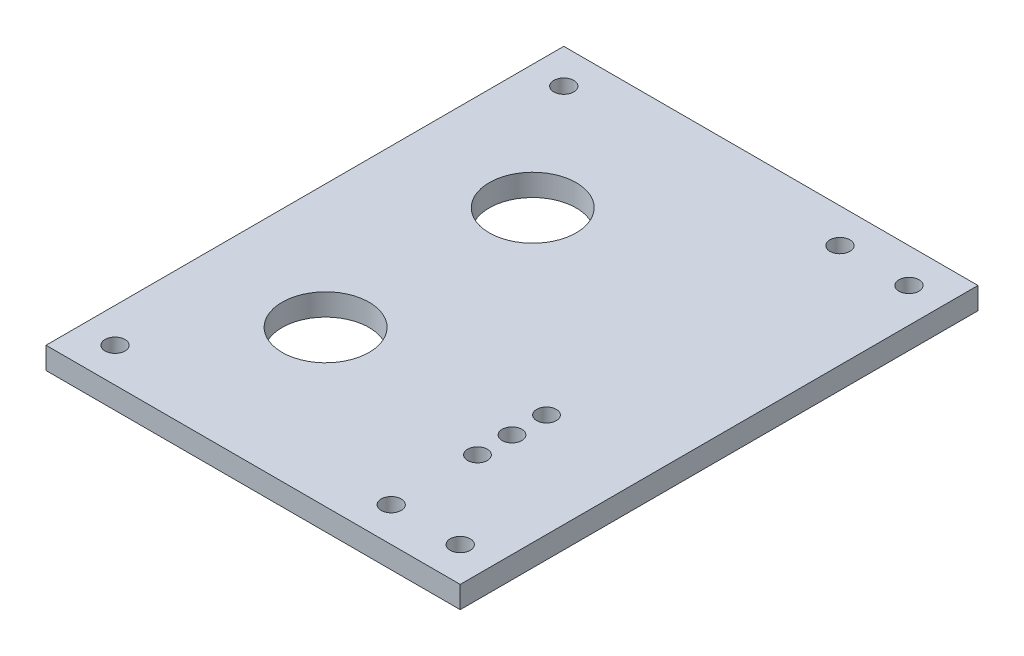
ISO-10303-21;
HEADER;
FILE_DESCRIPTION(('STEP AP214'),'2;1');
FILE_NAME('part.step','',(''),(''),'','','');
FILE_SCHEMA(('AUTOMOTIVE_DESIGN { 1 0 10303 214 1 1 1 1 }'));
ENDSEC;
DATA;
#1=APPLICATION_CONTEXT('core data for automotive mechanical design processes');
#2=APPLICATION_PROTOCOL_DEFINITION('international standard','automotive_design',2000,#1);
#3=PRODUCT_CONTEXT('',#1,'mechanical');
#4=PRODUCT('Part','Part','',(#3));
#5=PRODUCT_RELATED_PRODUCT_CATEGORY('part','',(#4));
#6=PRODUCT_DEFINITION_FORMATION('','',#4);
#7=PRODUCT_DEFINITION_CONTEXT('part definition',#1,'design');
#8=PRODUCT_DEFINITION('design','',#6,#7);
#9=PRODUCT_DEFINITION_SHAPE('','',#8);
#10=(LENGTH_UNIT() NAMED_UNIT(*) SI_UNIT(.MILLI.,.METRE.));
#11=(NAMED_UNIT(*) PLANE_ANGLE_UNIT() SI_UNIT($,.RADIAN.));
#12=(NAMED_UNIT(*) SI_UNIT($,.STERADIAN.) SOLID_ANGLE_UNIT());
#13=UNCERTAINTY_MEASURE_WITH_UNIT(LENGTH_MEASURE(1.E-05),#10,'distance_accuracy_value','');
#14=(GEOMETRIC_REPRESENTATION_CONTEXT(3) GLOBAL_UNCERTAINTY_ASSIGNED_CONTEXT((#13)) GLOBAL_UNIT_ASSIGNED_CONTEXT((#10,
#11,#12)) REPRESENTATION_CONTEXT('',''));
#15=CARTESIAN_POINT('',(0.,0.,0.));
#16=DIRECTION('',(0.,0.,1.));
#17=DIRECTION('',(1.,0.,0.));
#18=AXIS2_PLACEMENT_3D('',#15,#16,#17);
#19=CARTESIAN_POINT('',(30.,3.175,37.5));
#20=DIRECTION('',(-1.,0.,0.));
#21=DIRECTION('',(0.,0.,1.));
#22=AXIS2_PLACEMENT_3D('',#19,#20,#21);
#23=PLANE('',#22);
#24=DIRECTION('',(0.,0.,-1.));
#25=VECTOR('',#24,1.);
#26=CARTESIAN_POINT('',(30.,0.,37.5));
#27=LINE('',#26,#25);
#28=CARTESIAN_POINT('',(30.,0.,37.5));
#29=VERTEX_POINT('',#28);
#30=CARTESIAN_POINT('',(30.,0.,-37.5));
#31=VERTEX_POINT('',#30);
#32=EDGE_CURVE('E93',#29,#31,#27,.T.);
#33=ORIENTED_EDGE('',*,*,#32,.T.);
#34=DIRECTION('',(0.,-1.,0.));
#35=VECTOR('',#34,1.);
#36=CARTESIAN_POINT('',(30.,3.175,-37.5));
#37=LINE('',#36,#35);
#38=CARTESIAN_POINT('',(30.,3.175,-37.5));
#39=VERTEX_POINT('',#38);
#40=EDGE_CURVE('E11',#39,#31,#37,.T.);
#41=ORIENTED_EDGE('',*,*,#40,.F.);
#42=DIRECTION('',(0.,0.,-1.));
#43=VECTOR('',#42,1.);
#44=CARTESIAN_POINT('',(30.,3.175,37.5));
#45=LINE('',#44,#43);
#46=CARTESIAN_POINT('',(30.,3.175,37.5));
#47=VERTEX_POINT('',#46);
#48=EDGE_CURVE('E81',#47,#39,#45,.T.);
#49=ORIENTED_EDGE('',*,*,#48,.F.);
#50=DIRECTION('',(0.,-1.,0.));
#51=VECTOR('',#50,1.);
#52=CARTESIAN_POINT('',(30.,3.175,37.5));
#53=LINE('',#52,#51);
#54=EDGE_CURVE('E89',#47,#29,#53,.T.);
#55=ORIENTED_EDGE('',*,*,#54,.T.);
#56=EDGE_LOOP('',(#33,#41,#49,#55));
#57=FACE_BOUND('',#56,.T.);
#58=ADVANCED_FACE('F30',(#57),#23,.F.);
#59=CARTESIAN_POINT('',(-30.,3.175,-37.5));
#60=DIRECTION('',(0.,0.,1.));
#61=DIRECTION('',(1.,0.,0.));
#62=AXIS2_PLACEMENT_3D('',#59,#60,#61);
#63=PLANE('',#62);
#64=DIRECTION('',(-1.,0.,0.));
#65=VECTOR('',#64,1.);
#66=CARTESIAN_POINT('',(-30.,0.,-37.5));
#67=LINE('',#66,#65);
#68=CARTESIAN_POINT('',(-30.,0.,-37.5));
#69=VERTEX_POINT('',#68);
#70=EDGE_CURVE('E85',#31,#69,#67,.T.);
#71=ORIENTED_EDGE('',*,*,#70,.T.);
#72=DIRECTION('',(0.,-1.,0.));
#73=VECTOR('',#72,1.);
#74=CARTESIAN_POINT('',(-30.,3.175,-37.5));
#75=LINE('',#74,#73);
#76=CARTESIAN_POINT('',(-30.,3.175,-37.5));
#77=VERTEX_POINT('',#76);
#78=EDGE_CURVE('E38',#77,#69,#75,.T.);
#79=ORIENTED_EDGE('',*,*,#78,.F.);
#80=DIRECTION('',(-1.,0.,0.));
#81=VECTOR('',#80,1.);
#82=CARTESIAN_POINT('',(-30.,3.175,-37.5));
#83=LINE('',#82,#81);
#84=EDGE_CURVE('E76',#39,#77,#83,.T.);
#85=ORIENTED_EDGE('',*,*,#84,.F.);
#86=ORIENTED_EDGE('',*,*,#40,.T.);
#87=EDGE_LOOP('',(#71,#79,#85,#86));
#88=FACE_BOUND('',#87,.T.);
#89=ADVANCED_FACE('F84',(#88),#63,.F.);
#90=CARTESIAN_POINT('',(-30.,3.175,37.5));
#91=DIRECTION('',(1.,0.,0.));
#92=DIRECTION('',(0.,0.,-1.));
#93=AXIS2_PLACEMENT_3D('',#90,#91,#92);
#94=PLANE('',#93);
#95=DIRECTION('',(0.,0.,1.));
#96=VECTOR('',#95,1.);
#97=CARTESIAN_POINT('',(-30.,0.,37.5));
#98=LINE('',#97,#96);
#99=CARTESIAN_POINT('',(-30.,0.,37.5));
#100=VERTEX_POINT('',#99);
#101=EDGE_CURVE('E63',#69,#100,#98,.T.);
#102=ORIENTED_EDGE('',*,*,#101,.T.);
#103=DIRECTION('',(0.,-1.,0.));
#104=VECTOR('',#103,1.);
#105=CARTESIAN_POINT('',(-30.,3.175,37.5));
#106=LINE('',#105,#104);
#107=CARTESIAN_POINT('',(-30.,3.175,37.5));
#108=VERTEX_POINT('',#107);
#109=EDGE_CURVE('E86',#108,#100,#106,.T.);
#110=ORIENTED_EDGE('',*,*,#109,.F.);
#111=DIRECTION('',(0.,0.,1.));
#112=VECTOR('',#111,1.);
#113=CARTESIAN_POINT('',(-30.,3.175,37.5));
#114=LINE('',#113,#112);
#115=EDGE_CURVE('E79',#77,#108,#114,.T.);
#116=ORIENTED_EDGE('',*,*,#115,.F.);
#117=ORIENTED_EDGE('',*,*,#78,.T.);
#118=EDGE_LOOP('',(#102,#110,#116,#117));
#119=FACE_BOUND('',#118,.T.);
#120=ADVANCED_FACE('F87',(#119),#94,.F.);
#121=CARTESIAN_POINT('',(-30.,3.175,37.5));
#122=DIRECTION('',(0.,0.,-1.));
#123=DIRECTION('',(-1.,0.,0.));
#124=AXIS2_PLACEMENT_3D('',#121,#122,#123);
#125=PLANE('',#124);
#126=DIRECTION('',(1.,0.,0.));
#127=VECTOR('',#126,1.);
#128=CARTESIAN_POINT('',(-30.,0.,37.5));
#129=LINE('',#128,#127);
#130=EDGE_CURVE('E69',#100,#29,#129,.T.);
#131=ORIENTED_EDGE('',*,*,#130,.T.);
#132=ORIENTED_EDGE('',*,*,#54,.F.);
#133=DIRECTION('',(1.,0.,0.));
#134=VECTOR('',#133,1.);
#135=CARTESIAN_POINT('',(-30.,3.175,37.5));
#136=LINE('',#135,#134);
#137=EDGE_CURVE('E46',#108,#47,#136,.T.);
#138=ORIENTED_EDGE('',*,*,#137,.F.);
#139=ORIENTED_EDGE('',*,*,#109,.T.);
#140=EDGE_LOOP('',(#131,#132,#138,#139));
#141=FACE_BOUND('',#140,.T.);
#142=ADVANCED_FACE('F101',(#141),#125,.F.);
#143=CARTESIAN_POINT('',(30.,3.175,-37.5));
#144=DIRECTION('',(0.,-1.,0.));
#145=DIRECTION('',(0.,0.,-1.));
#146=AXIS2_PLACEMENT_3D('',#143,#144,#145);
#147=PLANE('',#146);
#148=CARTESIAN_POINT('',(15.,3.175,10.));
#149=DIRECTION('',(0.,1.,0.));
#150=DIRECTION('',(0.,0.,1.));
#151=AXIS2_PLACEMENT_3D('',#148,#149,#150);
#152=CIRCLE('',#151,1.425);
#153=CARTESIAN_POINT('',(15.,3.175,11.425));
#154=VERTEX_POINT('',#153);
#155=EDGE_CURVE('E167',#154,#154,#152,.T.);
#156=ORIENTED_EDGE('',*,*,#155,.F.);
#157=EDGE_LOOP('',(#156));
#158=FACE_BOUND('',#157,.T.);
#159=CARTESIAN_POINT('',(15.,3.175,15.));
#160=DIRECTION('',(0.,1.,0.));
#161=DIRECTION('',(0.,0.,1.));
#162=AXIS2_PLACEMENT_3D('',#159,#160,#161);
#163=CIRCLE('',#162,1.425);
#164=CARTESIAN_POINT('',(15.,3.175,16.425));
#165=VERTEX_POINT('',#164);
#166=EDGE_CURVE('E161',#165,#165,#163,.T.);
#167=ORIENTED_EDGE('',*,*,#166,.F.);
#168=EDGE_LOOP('',(#167));
#169=FACE_BOUND('',#168,.T.);
#170=CARTESIAN_POINT('',(15.,3.175,20.));
#171=DIRECTION('',(0.,1.,0.));
#172=DIRECTION('',(0.,0.,1.));
#173=AXIS2_PLACEMENT_3D('',#170,#171,#172);
#174=CIRCLE('',#173,1.425);
#175=CARTESIAN_POINT('',(15.,3.175,21.425));
#176=VERTEX_POINT('',#175);
#177=EDGE_CURVE('E155',#176,#176,#174,.T.);
#178=ORIENTED_EDGE('',*,*,#177,.F.);
#179=EDGE_LOOP('',(#178));
#180=FACE_BOUND('',#179,.T.);
#181=CARTESIAN_POINT('',(-12.,3.175,15.));
#182=DIRECTION('',(0.,1.,0.));
#183=DIRECTION('',(0.,0.,1.));
#184=AXIS2_PLACEMENT_3D('',#181,#182,#183);
#185=CIRCLE('',#184,6.29999999999999);
#186=CARTESIAN_POINT('',(-12.,3.175,21.3));
#187=VERTEX_POINT('',#186);
#188=EDGE_CURVE('E149',#187,#187,#185,.T.);
#189=ORIENTED_EDGE('',*,*,#188,.F.);
#190=EDGE_LOOP('',(#189));
#191=FACE_BOUND('',#190,.T.);
#192=CARTESIAN_POINT('',(-12.,3.175,-15.));
#193=DIRECTION('',(0.,1.,0.));
#194=DIRECTION('',(0.,0.,1.));
#195=AXIS2_PLACEMENT_3D('',#192,#193,#194);
#196=CIRCLE('',#195,6.29999999999999);
#197=CARTESIAN_POINT('',(-12.,3.175,-8.7));
#198=VERTEX_POINT('',#197);
#199=EDGE_CURVE('E143',#198,#198,#196,.T.);
#200=ORIENTED_EDGE('',*,*,#199,.F.);
#201=EDGE_LOOP('',(#200));
#202=FACE_BOUND('',#201,.T.);
#203=CARTESIAN_POINT('',(-25.,3.175,32.5));
#204=DIRECTION('',(0.,1.,0.));
#205=DIRECTION('',(0.,0.,-1.));
#206=AXIS2_PLACEMENT_3D('',#203,#204,#205);
#207=CIRCLE('',#206,1.45);
#208=CARTESIAN_POINT('',(-25.,3.175,31.05));
#209=VERTEX_POINT('',#208);
#210=EDGE_CURVE('E137',#209,#209,#207,.T.);
#211=ORIENTED_EDGE('',*,*,#210,.F.);
#212=EDGE_LOOP('',(#211));
#213=FACE_BOUND('',#212,.T.);
#214=CARTESIAN_POINT('',(15.,3.175,32.5));
#215=DIRECTION('',(0.,1.,0.));
#216=DIRECTION('',(0.,0.,-1.));
#217=AXIS2_PLACEMENT_3D('',#214,#215,#216);
#218=CIRCLE('',#217,1.45);
#219=CARTESIAN_POINT('',(15.,3.175,31.05));
#220=VERTEX_POINT('',#219);
#221=EDGE_CURVE('E131',#220,#220,#218,.T.);
#222=ORIENTED_EDGE('',*,*,#221,.F.);
#223=EDGE_LOOP('',(#222));
#224=FACE_BOUND('',#223,.T.);
#225=CARTESIAN_POINT('',(25.,3.175,32.5));
#226=DIRECTION('',(0.,1.,0.));
#227=DIRECTION('',(0.,0.,-1.));
#228=AXIS2_PLACEMENT_3D('',#225,#226,#227);
#229=CIRCLE('',#228,1.45);
#230=CARTESIAN_POINT('',(25.,3.175,31.05));
#231=VERTEX_POINT('',#230);
#232=EDGE_CURVE('E125',#231,#231,#229,.T.);
#233=ORIENTED_EDGE('',*,*,#232,.F.);
#234=EDGE_LOOP('',(#233));
#235=FACE_BOUND('',#234,.T.);
#236=CARTESIAN_POINT('',(15.,3.175,-32.5));
#237=DIRECTION('',(0.,1.,0.));
#238=DIRECTION('',(0.,0.,1.));
#239=AXIS2_PLACEMENT_3D('',#236,#237,#238);
#240=CIRCLE('',#239,1.45);
#241=CARTESIAN_POINT('',(15.,3.175,-31.05));
#242=VERTEX_POINT('',#241);
#243=EDGE_CURVE('E119',#242,#242,#240,.T.);
#244=ORIENTED_EDGE('',*,*,#243,.F.);
#245=EDGE_LOOP('',(#244));
#246=FACE_BOUND('',#245,.T.);
#247=CARTESIAN_POINT('',(-25.,3.175,-32.5));
#248=DIRECTION('',(0.,1.,0.));
#249=DIRECTION('',(0.,0.,1.));
#250=AXIS2_PLACEMENT_3D('',#247,#248,#249);
#251=CIRCLE('',#250,1.45);
#252=CARTESIAN_POINT('',(-25.,3.175,-31.05));
#253=VERTEX_POINT('',#252);
#254=EDGE_CURVE('E113',#253,#253,#251,.T.);
#255=ORIENTED_EDGE('',*,*,#254,.F.);
#256=EDGE_LOOP('',(#255));
#257=FACE_BOUND('',#256,.T.);
#258=CARTESIAN_POINT('',(25.,3.175,-32.5));
#259=DIRECTION('',(0.,1.,0.));
#260=DIRECTION('',(0.,0.,1.));
#261=AXIS2_PLACEMENT_3D('',#258,#259,#260);
#262=CIRCLE('',#261,1.45);
#263=CARTESIAN_POINT('',(25.,3.175,-31.05));
#264=VERTEX_POINT('',#263);
#265=EDGE_CURVE('E107',#264,#264,#262,.T.);
#266=ORIENTED_EDGE('',*,*,#265,.F.);
#267=EDGE_LOOP('',(#266));
#268=FACE_BOUND('',#267,.T.);
#269=ORIENTED_EDGE('',*,*,#48,.T.);
#270=ORIENTED_EDGE('',*,*,#84,.T.);
#271=ORIENTED_EDGE('',*,*,#115,.T.);
#272=ORIENTED_EDGE('',*,*,#137,.T.);
#273=EDGE_LOOP('',(#269,#270,#271,#272));
#274=FACE_BOUND('',#273,.T.);
#275=ADVANCED_FACE('F77',(#158,#169,#180,#191,#202,#213,#224,#235,#246,#257,#268,#274),#147,.F.);
#276=CARTESIAN_POINT('',(30.,0.,-37.5));
#277=DIRECTION('',(0.,-1.,0.));
#278=DIRECTION('',(0.,0.,-1.));
#279=AXIS2_PLACEMENT_3D('',#276,#277,#278);
#280=PLANE('',#279);
#281=CARTESIAN_POINT('',(15.,0.,10.));
#282=DIRECTION('',(0.,1.,0.));
#283=DIRECTION('',(0.,0.,1.));
#284=AXIS2_PLACEMENT_3D('',#281,#282,#283);
#285=CIRCLE('',#284,1.425);
#286=CARTESIAN_POINT('',(15.,0.,11.425));
#287=VERTEX_POINT('',#286);
#288=EDGE_CURVE('E164',#287,#287,#285,.T.);
#289=ORIENTED_EDGE('',*,*,#288,.T.);
#290=EDGE_LOOP('',(#289));
#291=FACE_BOUND('',#290,.T.);
#292=CARTESIAN_POINT('',(15.,0.,15.));
#293=DIRECTION('',(0.,1.,0.));
#294=DIRECTION('',(0.,0.,1.));
#295=AXIS2_PLACEMENT_3D('',#292,#293,#294);
#296=CIRCLE('',#295,1.425);
#297=CARTESIAN_POINT('',(15.,0.,16.425));
#298=VERTEX_POINT('',#297);
#299=EDGE_CURVE('E158',#298,#298,#296,.T.);
#300=ORIENTED_EDGE('',*,*,#299,.T.);
#301=EDGE_LOOP('',(#300));
#302=FACE_BOUND('',#301,.T.);
#303=CARTESIAN_POINT('',(15.,0.,20.));
#304=DIRECTION('',(0.,1.,0.));
#305=DIRECTION('',(0.,0.,1.));
#306=AXIS2_PLACEMENT_3D('',#303,#304,#305);
#307=CIRCLE('',#306,1.425);
#308=CARTESIAN_POINT('',(15.,0.,21.425));
#309=VERTEX_POINT('',#308);
#310=EDGE_CURVE('E152',#309,#309,#307,.T.);
#311=ORIENTED_EDGE('',*,*,#310,.T.);
#312=EDGE_LOOP('',(#311));
#313=FACE_BOUND('',#312,.T.);
#314=CARTESIAN_POINT('',(-12.,0.,15.));
#315=DIRECTION('',(0.,1.,0.));
#316=DIRECTION('',(0.,0.,1.));
#317=AXIS2_PLACEMENT_3D('',#314,#315,#316);
#318=CIRCLE('',#317,6.29999999999999);
#319=CARTESIAN_POINT('',(-12.,0.,21.3));
#320=VERTEX_POINT('',#319);
#321=EDGE_CURVE('E146',#320,#320,#318,.T.);
#322=ORIENTED_EDGE('',*,*,#321,.T.);
#323=EDGE_LOOP('',(#322));
#324=FACE_BOUND('',#323,.T.);
#325=CARTESIAN_POINT('',(-12.,0.,-15.));
#326=DIRECTION('',(0.,1.,0.));
#327=DIRECTION('',(0.,0.,1.));
#328=AXIS2_PLACEMENT_3D('',#325,#326,#327);
#329=CIRCLE('',#328,6.29999999999999);
#330=CARTESIAN_POINT('',(-12.,0.,-8.7));
#331=VERTEX_POINT('',#330);
#332=EDGE_CURVE('E140',#331,#331,#329,.T.);
#333=ORIENTED_EDGE('',*,*,#332,.T.);
#334=EDGE_LOOP('',(#333));
#335=FACE_BOUND('',#334,.T.);
#336=CARTESIAN_POINT('',(-25.,0.,32.5));
#337=DIRECTION('',(0.,1.,0.));
#338=DIRECTION('',(0.,0.,-1.));
#339=AXIS2_PLACEMENT_3D('',#336,#337,#338);
#340=CIRCLE('',#339,1.45);
#341=CARTESIAN_POINT('',(-25.,0.,31.05));
#342=VERTEX_POINT('',#341);
#343=EDGE_CURVE('E134',#342,#342,#340,.T.);
#344=ORIENTED_EDGE('',*,*,#343,.T.);
#345=EDGE_LOOP('',(#344));
#346=FACE_BOUND('',#345,.T.);
#347=CARTESIAN_POINT('',(15.,0.,32.5));
#348=DIRECTION('',(0.,1.,0.));
#349=DIRECTION('',(0.,0.,-1.));
#350=AXIS2_PLACEMENT_3D('',#347,#348,#349);
#351=CIRCLE('',#350,1.45);
#352=CARTESIAN_POINT('',(15.,0.,31.05));
#353=VERTEX_POINT('',#352);
#354=EDGE_CURVE('E128',#353,#353,#351,.T.);
#355=ORIENTED_EDGE('',*,*,#354,.T.);
#356=EDGE_LOOP('',(#355));
#357=FACE_BOUND('',#356,.T.);
#358=CARTESIAN_POINT('',(25.,0.,32.5));
#359=DIRECTION('',(0.,1.,0.));
#360=DIRECTION('',(0.,0.,-1.));
#361=AXIS2_PLACEMENT_3D('',#358,#359,#360);
#362=CIRCLE('',#361,1.45);
#363=CARTESIAN_POINT('',(25.,0.,31.05));
#364=VERTEX_POINT('',#363);
#365=EDGE_CURVE('E122',#364,#364,#362,.T.);
#366=ORIENTED_EDGE('',*,*,#365,.T.);
#367=EDGE_LOOP('',(#366));
#368=FACE_BOUND('',#367,.T.);
#369=CARTESIAN_POINT('',(15.,0.,-32.5));
#370=DIRECTION('',(0.,1.,0.));
#371=DIRECTION('',(0.,0.,1.));
#372=AXIS2_PLACEMENT_3D('',#369,#370,#371);
#373=CIRCLE('',#372,1.45);
#374=CARTESIAN_POINT('',(15.,0.,-31.05));
#375=VERTEX_POINT('',#374);
#376=EDGE_CURVE('E116',#375,#375,#373,.T.);
#377=ORIENTED_EDGE('',*,*,#376,.T.);
#378=EDGE_LOOP('',(#377));
#379=FACE_BOUND('',#378,.T.);
#380=CARTESIAN_POINT('',(-25.,0.,-32.5));
#381=DIRECTION('',(0.,1.,0.));
#382=DIRECTION('',(0.,0.,1.));
#383=AXIS2_PLACEMENT_3D('',#380,#381,#382);
#384=CIRCLE('',#383,1.45);
#385=CARTESIAN_POINT('',(-25.,0.,-31.05));
#386=VERTEX_POINT('',#385);
#387=EDGE_CURVE('E110',#386,#386,#384,.T.);
#388=ORIENTED_EDGE('',*,*,#387,.T.);
#389=EDGE_LOOP('',(#388));
#390=FACE_BOUND('',#389,.T.);
#391=CARTESIAN_POINT('',(25.,0.,-32.5));
#392=DIRECTION('',(0.,1.,0.));
#393=DIRECTION('',(0.,0.,1.));
#394=AXIS2_PLACEMENT_3D('',#391,#392,#393);
#395=CIRCLE('',#394,1.45);
#396=CARTESIAN_POINT('',(25.,0.,-31.05));
#397=VERTEX_POINT('',#396);
#398=EDGE_CURVE('E96',#397,#397,#395,.T.);
#399=ORIENTED_EDGE('',*,*,#398,.T.);
#400=EDGE_LOOP('',(#399));
#401=FACE_BOUND('',#400,.T.);
#402=ORIENTED_EDGE('',*,*,#32,.F.);
#403=ORIENTED_EDGE('',*,*,#130,.F.);
#404=ORIENTED_EDGE('',*,*,#101,.F.);
#405=ORIENTED_EDGE('',*,*,#70,.F.);
#406=EDGE_LOOP('',(#402,#403,#404,#405));
#407=FACE_BOUND('',#406,.T.);
#408=ADVANCED_FACE('F104',(#291,#302,#313,#324,#335,#346,#357,#368,#379,#390,#401,#407),#280,.T.);
#409=CARTESIAN_POINT('',(25.,0.,-32.5));
#410=DIRECTION('',(0.,1.,0.));
#411=DIRECTION('',(0.,0.,1.));
#412=AXIS2_PLACEMENT_3D('',#409,#410,#411);
#413=CYLINDRICAL_SURFACE('',#412,1.45);
#414=ORIENTED_EDGE('',*,*,#398,.F.);
#415=EDGE_LOOP('',(#414));
#416=FACE_BOUND('',#415,.T.);
#417=ORIENTED_EDGE('',*,*,#265,.T.);
#418=EDGE_LOOP('',(#417));
#419=FACE_BOUND('',#418,.T.);
#420=ADVANCED_FACE('F205',(#416,#419),#413,.F.);
#421=CARTESIAN_POINT('',(-25.,0.,-32.5));
#422=DIRECTION('',(0.,1.,0.));
#423=DIRECTION('',(0.,0.,1.));
#424=AXIS2_PLACEMENT_3D('',#421,#422,#423);
#425=CYLINDRICAL_SURFACE('',#424,1.45);
#426=ORIENTED_EDGE('',*,*,#387,.F.);
#427=EDGE_LOOP('',(#426));
#428=FACE_BOUND('',#427,.T.);
#429=ORIENTED_EDGE('',*,*,#254,.T.);
#430=EDGE_LOOP('',(#429));
#431=FACE_BOUND('',#430,.T.);
#432=ADVANCED_FACE('F207',(#428,#431),#425,.F.);
#433=CARTESIAN_POINT('',(15.,0.,-32.5));
#434=DIRECTION('',(0.,1.,0.));
#435=DIRECTION('',(0.,0.,1.));
#436=AXIS2_PLACEMENT_3D('',#433,#434,#435);
#437=CYLINDRICAL_SURFACE('',#436,1.45);
#438=ORIENTED_EDGE('',*,*,#376,.F.);
#439=EDGE_LOOP('',(#438));
#440=FACE_BOUND('',#439,.T.);
#441=ORIENTED_EDGE('',*,*,#243,.T.);
#442=EDGE_LOOP('',(#441));
#443=FACE_BOUND('',#442,.T.);
#444=ADVANCED_FACE('F214',(#440,#443),#437,.F.);
#445=CARTESIAN_POINT('',(25.,0.,32.5));
#446=DIRECTION('',(0.,1.,0.));
#447=DIRECTION('',(0.,0.,1.));
#448=AXIS2_PLACEMENT_3D('',#445,#446,#447);
#449=CYLINDRICAL_SURFACE('',#448,1.45);
#450=ORIENTED_EDGE('',*,*,#365,.F.);
#451=EDGE_LOOP('',(#450));
#452=FACE_BOUND('',#451,.T.);
#453=ORIENTED_EDGE('',*,*,#232,.T.);
#454=EDGE_LOOP('',(#453));
#455=FACE_BOUND('',#454,.T.);
#456=ADVANCED_FACE('F303',(#452,#455),#449,.F.);
#457=CARTESIAN_POINT('',(15.,0.,32.5));
#458=DIRECTION('',(0.,1.,0.));
#459=DIRECTION('',(0.,0.,1.));
#460=AXIS2_PLACEMENT_3D('',#457,#458,#459);
#461=CYLINDRICAL_SURFACE('',#460,1.45);
#462=ORIENTED_EDGE('',*,*,#354,.F.);
#463=EDGE_LOOP('',(#462));
#464=FACE_BOUND('',#463,.T.);
#465=ORIENTED_EDGE('',*,*,#221,.T.);
#466=EDGE_LOOP('',(#465));
#467=FACE_BOUND('',#466,.T.);
#468=ADVANCED_FACE('F299',(#464,#467),#461,.F.);
#469=CARTESIAN_POINT('',(-25.,0.,32.5));
#470=DIRECTION('',(0.,1.,0.));
#471=DIRECTION('',(0.,0.,1.));
#472=AXIS2_PLACEMENT_3D('',#469,#470,#471);
#473=CYLINDRICAL_SURFACE('',#472,1.45);
#474=ORIENTED_EDGE('',*,*,#343,.F.);
#475=EDGE_LOOP('',(#474));
#476=FACE_BOUND('',#475,.T.);
#477=ORIENTED_EDGE('',*,*,#210,.T.);
#478=EDGE_LOOP('',(#477));
#479=FACE_BOUND('',#478,.T.);
#480=ADVANCED_FACE('F254',(#476,#479),#473,.F.);
#481=CARTESIAN_POINT('',(-12.,0.,-15.));
#482=DIRECTION('',(0.,1.,0.));
#483=DIRECTION('',(0.,0.,1.));
#484=AXIS2_PLACEMENT_3D('',#481,#482,#483);
#485=CYLINDRICAL_SURFACE('',#484,6.29999999999999);
#486=ORIENTED_EDGE('',*,*,#332,.F.);
#487=EDGE_LOOP('',(#486));
#488=FACE_BOUND('',#487,.T.);
#489=ORIENTED_EDGE('',*,*,#199,.T.);
#490=EDGE_LOOP('',(#489));
#491=FACE_BOUND('',#490,.T.);
#492=ADVANCED_FACE('F248',(#488,#491),#485,.F.);
#493=CARTESIAN_POINT('',(-12.,0.,15.));
#494=DIRECTION('',(0.,1.,0.));
#495=DIRECTION('',(0.,0.,1.));
#496=AXIS2_PLACEMENT_3D('',#493,#494,#495);
#497=CYLINDRICAL_SURFACE('',#496,6.29999999999999);
#498=ORIENTED_EDGE('',*,*,#321,.F.);
#499=EDGE_LOOP('',(#498));
#500=FACE_BOUND('',#499,.T.);
#501=ORIENTED_EDGE('',*,*,#188,.T.);
#502=EDGE_LOOP('',(#501));
#503=FACE_BOUND('',#502,.T.);
#504=ADVANCED_FACE('F253',(#500,#503),#497,.F.);
#505=CARTESIAN_POINT('',(15.,0.,20.));
#506=DIRECTION('',(0.,1.,0.));
#507=DIRECTION('',(0.,0.,1.));
#508=AXIS2_PLACEMENT_3D('',#505,#506,#507);
#509=CYLINDRICAL_SURFACE('',#508,1.425);
#510=ORIENTED_EDGE('',*,*,#310,.F.);
#511=EDGE_LOOP('',(#510));
#512=FACE_BOUND('',#511,.T.);
#513=ORIENTED_EDGE('',*,*,#177,.T.);
#514=EDGE_LOOP('',(#513));
#515=FACE_BOUND('',#514,.T.);
#516=ADVANCED_FACE('F266',(#512,#515),#509,.F.);
#517=CARTESIAN_POINT('',(15.,0.,15.));
#518=DIRECTION('',(0.,1.,0.));
#519=DIRECTION('',(0.,0.,1.));
#520=AXIS2_PLACEMENT_3D('',#517,#518,#519);
#521=CYLINDRICAL_SURFACE('',#520,1.425);
#522=ORIENTED_EDGE('',*,*,#299,.F.);
#523=EDGE_LOOP('',(#522));
#524=FACE_BOUND('',#523,.T.);
#525=ORIENTED_EDGE('',*,*,#166,.T.);
#526=EDGE_LOOP('',(#525));
#527=FACE_BOUND('',#526,.T.);
#528=ADVANCED_FACE('F178',(#524,#527),#521,.F.);
#529=CARTESIAN_POINT('',(15.,0.,10.));
#530=DIRECTION('',(0.,1.,0.));
#531=DIRECTION('',(0.,0.,1.));
#532=AXIS2_PLACEMENT_3D('',#529,#530,#531);
#533=CYLINDRICAL_SURFACE('',#532,1.425);
#534=ORIENTED_EDGE('',*,*,#288,.F.);
#535=EDGE_LOOP('',(#534));
#536=FACE_BOUND('',#535,.T.);
#537=ORIENTED_EDGE('',*,*,#155,.T.);
#538=EDGE_LOOP('',(#537));
#539=FACE_BOUND('',#538,.T.);
#540=ADVANCED_FACE('F175',(#536,#539),#533,.F.);
#541=CLOSED_SHELL('',(#58,#89,#120,#142,#275,#408,#420,#432,#444,#456,#468,#480,#492,#504,#516,
#528,#540));
#542=MANIFOLD_SOLID_BREP('B2',#541);
#543=ADVANCED_BREP_SHAPE_REPRESENTATION('',(#18,#542),#14);
#544=SHAPE_DEFINITION_REPRESENTATION(#9,#543);
ENDSEC;
END-ISO-10303-21;
